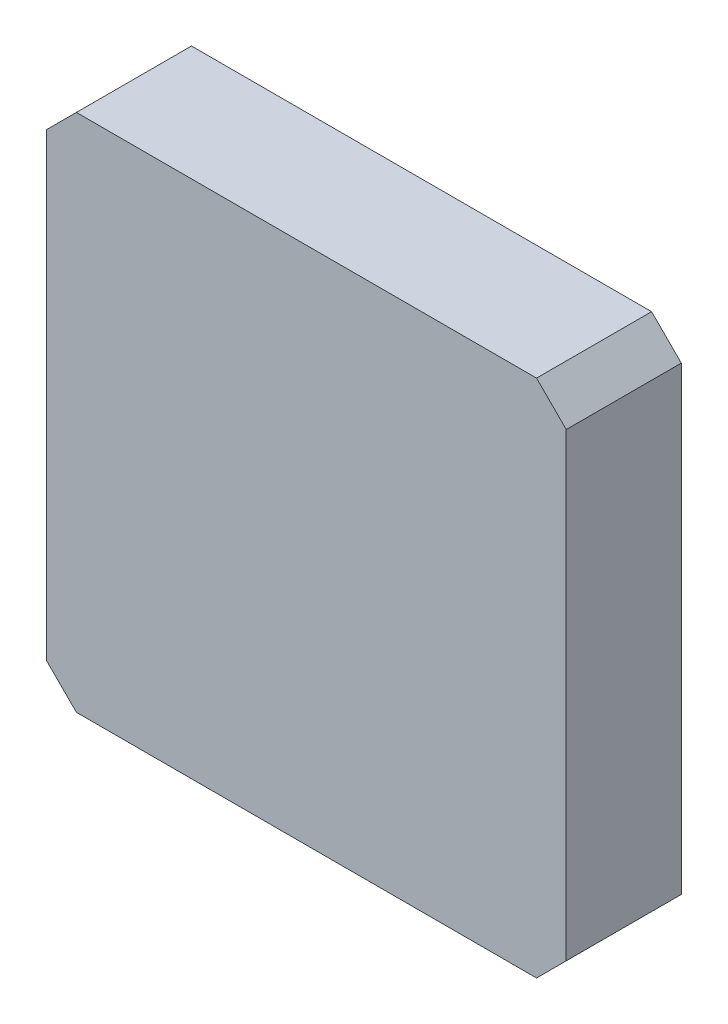
ISO-10303-21;
HEADER;
FILE_DESCRIPTION(('STEP AP214'),'2;1');
FILE_NAME('part.step','',(''),(''),'','','');
FILE_SCHEMA(('AUTOMOTIVE_DESIGN { 1 0 10303 214 1 1 1 1 }'));
ENDSEC;
DATA;
#1=APPLICATION_CONTEXT('core data for automotive mechanical design processes');
#2=APPLICATION_PROTOCOL_DEFINITION('international standard','automotive_design',2000,#1);
#3=PRODUCT_CONTEXT('',#1,'mechanical');
#4=PRODUCT('Part','Part','',(#3));
#5=PRODUCT_RELATED_PRODUCT_CATEGORY('part','',(#4));
#6=PRODUCT_DEFINITION_FORMATION('','',#4);
#7=PRODUCT_DEFINITION_CONTEXT('part definition',#1,'design');
#8=PRODUCT_DEFINITION('design','',#6,#7);
#9=PRODUCT_DEFINITION_SHAPE('','',#8);
#10=(LENGTH_UNIT() NAMED_UNIT(*) SI_UNIT(.MILLI.,.METRE.));
#11=(NAMED_UNIT(*) PLANE_ANGLE_UNIT() SI_UNIT($,.RADIAN.));
#12=(NAMED_UNIT(*) SI_UNIT($,.STERADIAN.) SOLID_ANGLE_UNIT());
#13=UNCERTAINTY_MEASURE_WITH_UNIT(LENGTH_MEASURE(1.E-05),#10,'distance_accuracy_value','');
#14=(GEOMETRIC_REPRESENTATION_CONTEXT(3) GLOBAL_UNCERTAINTY_ASSIGNED_CONTEXT((#13)) GLOBAL_UNIT_ASSIGNED_CONTEXT((#10,
#11,#12)) REPRESENTATION_CONTEXT('',''));
#15=CARTESIAN_POINT('',(0.,0.,0.));
#16=DIRECTION('',(0.,0.,1.));
#17=DIRECTION('',(1.,0.,0.));
#18=AXIS2_PLACEMENT_3D('',#15,#16,#17);
#19=CARTESIAN_POINT('',(-3.09999888,-3.49999808,0.));
#20=DIRECTION('',(0.,0.,1.));
#21=DIRECTION('',(1.,0.,0.));
#22=AXIS2_PLACEMENT_3D('',#19,#20,#21);
#23=PLANE('',#22);
#24=DIRECTION('',(0.,-1.,0.));
#25=VECTOR('',#24,1.);
#26=CARTESIAN_POINT('',(-3.49999808,-3.49999808,0.));
#27=LINE('',#26,#25);
#28=CARTESIAN_POINT('',(-3.49999808,3.10000142,0.));
#29=VERTEX_POINT('',#28);
#30=CARTESIAN_POINT('',(-3.49999808,-3.09999888,0.));
#31=VERTEX_POINT('',#30);
#32=EDGE_CURVE('E11',#29,#31,#27,.T.);
#33=ORIENTED_EDGE('',*,*,#32,.F.);
#34=DIRECTION('',(-0.707106781186548,-0.707106781186548,0.));
#35=VECTOR('',#34,1.);
#36=CARTESIAN_POINT('',(-3.49999808,3.10000142,0.));
#37=LINE('',#36,#35);
#38=CARTESIAN_POINT('',(-3.09999888,3.50000062,0.));
#39=VERTEX_POINT('',#38);
#40=EDGE_CURVE('E162',#39,#29,#37,.T.);
#41=ORIENTED_EDGE('',*,*,#40,.F.);
#42=DIRECTION('',(-1.,0.,0.));
#43=VECTOR('',#42,1.);
#44=CARTESIAN_POINT('',(-3.09999888,3.50000062,0.));
#45=LINE('',#44,#43);
#46=CARTESIAN_POINT('',(3.10000142,3.50000062,0.));
#47=VERTEX_POINT('',#46);
#48=EDGE_CURVE('E27',#47,#39,#45,.T.);
#49=ORIENTED_EDGE('',*,*,#48,.F.);
#50=DIRECTION('',(-0.707106781186548,0.707106781186548,0.));
#51=VECTOR('',#50,1.);
#52=CARTESIAN_POINT('',(3.10000142,3.50000062,0.));
#53=LINE('',#52,#51);
#54=CARTESIAN_POINT('',(3.50000062,3.10000142,0.));
#55=VERTEX_POINT('',#54);
#56=EDGE_CURVE('E144',#55,#47,#53,.T.);
#57=ORIENTED_EDGE('',*,*,#56,.F.);
#58=DIRECTION('',(0.,1.,0.));
#59=VECTOR('',#58,1.);
#60=CARTESIAN_POINT('',(3.50000062,-3.49999808,0.));
#61=LINE('',#60,#59);
#62=CARTESIAN_POINT('',(3.50000062,-3.09999888,0.));
#63=VERTEX_POINT('',#62);
#64=EDGE_CURVE('E169',#63,#55,#61,.T.);
#65=ORIENTED_EDGE('',*,*,#64,.F.);
#66=DIRECTION('',(0.707106781186548,0.707106781186548,0.));
#67=VECTOR('',#66,1.);
#68=CARTESIAN_POINT('',(3.50000062,-3.09999888,0.));
#69=LINE('',#68,#67);
#70=CARTESIAN_POINT('',(3.10000142,-3.49999808,0.));
#71=VERTEX_POINT('',#70);
#72=EDGE_CURVE('E127',#71,#63,#69,.T.);
#73=ORIENTED_EDGE('',*,*,#72,.F.);
#74=DIRECTION('',(1.,0.,0.));
#75=VECTOR('',#74,1.);
#76=CARTESIAN_POINT('',(-3.09999888,-3.49999808,0.));
#77=LINE('',#76,#75);
#78=CARTESIAN_POINT('',(-3.09999888,-3.49999808,0.));
#79=VERTEX_POINT('',#78);
#80=EDGE_CURVE('E165',#79,#71,#77,.T.);
#81=ORIENTED_EDGE('',*,*,#80,.F.);
#82=DIRECTION('',(0.707106781186548,-0.707106781186548,0.));
#83=VECTOR('',#82,1.);
#84=CARTESIAN_POINT('',(-3.09999888,-3.49999808,0.));
#85=LINE('',#84,#83);
#86=EDGE_CURVE('E111',#31,#79,#85,.T.);
#87=ORIENTED_EDGE('',*,*,#86,.F.);
#88=EDGE_LOOP('',(#33,#41,#49,#57,#65,#73,#81,#87));
#89=FACE_BOUND('',#88,.T.);
#90=ADVANCED_FACE('F17',(#89),#23,.F.);
#91=CARTESIAN_POINT('',(-3.49999808,-3.09999888,0.));
#92=DIRECTION('',(-1.,0.,0.));
#93=DIRECTION('',(0.,0.,1.));
#94=AXIS2_PLACEMENT_3D('',#91,#92,#93);
#95=PLANE('',#94);
#96=DIRECTION('',(0.,0.,-1.));
#97=VECTOR('',#96,1.);
#98=CARTESIAN_POINT('',(-3.49999808,3.10000142,0.));
#99=LINE('',#98,#97);
#100=CARTESIAN_POINT('',(-3.49999808,3.10000142,1.55));
#101=VERTEX_POINT('',#100);
#102=EDGE_CURVE('E54',#101,#29,#99,.T.);
#103=ORIENTED_EDGE('',*,*,#102,.T.);
#104=ORIENTED_EDGE('',*,*,#32,.T.);
#105=DIRECTION('',(0.,0.,1.));
#106=VECTOR('',#105,1.);
#107=CARTESIAN_POINT('',(-3.49999808,-3.09999888,0.));
#108=LINE('',#107,#106);
#109=CARTESIAN_POINT('',(-3.49999808,-3.09999888,1.55));
#110=VERTEX_POINT('',#109);
#111=EDGE_CURVE('E105',#31,#110,#108,.T.);
#112=ORIENTED_EDGE('',*,*,#111,.T.);
#113=DIRECTION('',(0.,1.,0.));
#114=VECTOR('',#113,1.);
#115=CARTESIAN_POINT('',(-3.49999808,-3.09999888,1.55));
#116=LINE('',#115,#114);
#117=EDGE_CURVE('E90',#110,#101,#116,.T.);
#118=ORIENTED_EDGE('',*,*,#117,.T.);
#119=EDGE_LOOP('',(#103,#104,#112,#118));
#120=FACE_BOUND('',#119,.T.);
#121=ADVANCED_FACE('F109',(#120),#95,.T.);
#122=CARTESIAN_POINT('',(-3.09999888,3.50000062,0.));
#123=DIRECTION('',(0.,1.,0.));
#124=DIRECTION('',(1.,0.,0.));
#125=AXIS2_PLACEMENT_3D('',#122,#123,#124);
#126=PLANE('',#125);
#127=DIRECTION('',(0.,0.,-1.));
#128=VECTOR('',#127,1.);
#129=CARTESIAN_POINT('',(3.10000142,3.50000062,0.));
#130=LINE('',#129,#128);
#131=CARTESIAN_POINT('',(3.10000142,3.50000062,1.55));
#132=VERTEX_POINT('',#131);
#133=EDGE_CURVE('E121',#132,#47,#130,.T.);
#134=ORIENTED_EDGE('',*,*,#133,.T.);
#135=ORIENTED_EDGE('',*,*,#48,.T.);
#136=DIRECTION('',(0.,0.,1.));
#137=VECTOR('',#136,1.);
#138=CARTESIAN_POINT('',(-3.09999888,3.50000062,0.));
#139=LINE('',#138,#137);
#140=CARTESIAN_POINT('',(-3.09999888,3.50000062,1.55));
#141=VERTEX_POINT('',#140);
#142=EDGE_CURVE('E159',#39,#141,#139,.T.);
#143=ORIENTED_EDGE('',*,*,#142,.T.);
#144=DIRECTION('',(1.,0.,0.));
#145=VECTOR('',#144,1.);
#146=CARTESIAN_POINT('',(-3.09999888,3.50000062,1.55));
#147=LINE('',#146,#145);
#148=EDGE_CURVE('E125',#141,#132,#147,.T.);
#149=ORIENTED_EDGE('',*,*,#148,.T.);
#150=EDGE_LOOP('',(#134,#135,#143,#149));
#151=FACE_BOUND('',#150,.T.);
#152=ADVANCED_FACE('F19',(#151),#126,.T.);
#153=CARTESIAN_POINT('',(3.50000062,3.10000142,0.));
#154=DIRECTION('',(1.,0.,0.));
#155=DIRECTION('',(0.,1.,0.));
#156=AXIS2_PLACEMENT_3D('',#153,#154,#155);
#157=PLANE('',#156);
#158=DIRECTION('',(0.,0.,-1.));
#159=VECTOR('',#158,1.);
#160=CARTESIAN_POINT('',(3.50000062,-3.09999888,0.));
#161=LINE('',#160,#159);
#162=CARTESIAN_POINT('',(3.50000062,-3.09999888,1.55));
#163=VERTEX_POINT('',#162);
#164=EDGE_CURVE('E130',#163,#63,#161,.T.);
#165=ORIENTED_EDGE('',*,*,#164,.T.);
#166=ORIENTED_EDGE('',*,*,#64,.T.);
#167=DIRECTION('',(0.,0.,1.));
#168=VECTOR('',#167,1.);
#169=CARTESIAN_POINT('',(3.50000062,3.10000142,0.));
#170=LINE('',#169,#168);
#171=CARTESIAN_POINT('',(3.50000062,3.10000142,1.55));
#172=VERTEX_POINT('',#171);
#173=EDGE_CURVE('E139',#55,#172,#170,.T.);
#174=ORIENTED_EDGE('',*,*,#173,.T.);
#175=DIRECTION('',(0.,-1.,0.));
#176=VECTOR('',#175,1.);
#177=CARTESIAN_POINT('',(3.50000062,3.10000142,1.55));
#178=LINE('',#177,#176);
#179=EDGE_CURVE('E153',#172,#163,#178,.T.);
#180=ORIENTED_EDGE('',*,*,#179,.T.);
#181=EDGE_LOOP('',(#165,#166,#174,#180));
#182=FACE_BOUND('',#181,.T.);
#183=ADVANCED_FACE('F262',(#182),#157,.T.);
#184=CARTESIAN_POINT('',(3.10000142,-3.49999808,0.));
#185=DIRECTION('',(0.,-1.,0.));
#186=DIRECTION('',(0.,0.,-1.));
#187=AXIS2_PLACEMENT_3D('',#184,#185,#186);
#188=PLANE('',#187);
#189=DIRECTION('',(0.,0.,-1.));
#190=VECTOR('',#189,1.);
#191=CARTESIAN_POINT('',(-3.09999888,-3.49999808,0.));
#192=LINE('',#191,#190);
#193=CARTESIAN_POINT('',(-3.09999888,-3.49999808,1.55));
#194=VERTEX_POINT('',#193);
#195=EDGE_CURVE('E106',#194,#79,#192,.T.);
#196=ORIENTED_EDGE('',*,*,#195,.T.);
#197=ORIENTED_EDGE('',*,*,#80,.T.);
#198=DIRECTION('',(0.,0.,1.));
#199=VECTOR('',#198,1.);
#200=CARTESIAN_POINT('',(3.10000142,-3.49999808,0.));
#201=LINE('',#200,#199);
#202=CARTESIAN_POINT('',(3.10000142,-3.49999808,1.55));
#203=VERTEX_POINT('',#202);
#204=EDGE_CURVE('E131',#71,#203,#201,.T.);
#205=ORIENTED_EDGE('',*,*,#204,.T.);
#206=DIRECTION('',(-1.,0.,0.));
#207=VECTOR('',#206,1.);
#208=CARTESIAN_POINT('',(3.10000142,-3.49999808,1.55));
#209=LINE('',#208,#207);
#210=EDGE_CURVE('E67',#203,#194,#209,.T.);
#211=ORIENTED_EDGE('',*,*,#210,.T.);
#212=EDGE_LOOP('',(#196,#197,#205,#211));
#213=FACE_BOUND('',#212,.T.);
#214=ADVANCED_FACE('F239',(#213),#188,.T.);
#215=CARTESIAN_POINT('',(-3.49999808,3.10000142,0.));
#216=DIRECTION('',(-0.707106781186548,0.707106781186548,0.));
#217=DIRECTION('',(0.,0.,1.));
#218=AXIS2_PLACEMENT_3D('',#215,#216,#217);
#219=PLANE('',#218);
#220=ORIENTED_EDGE('',*,*,#142,.F.);
#221=ORIENTED_EDGE('',*,*,#40,.T.);
#222=ORIENTED_EDGE('',*,*,#102,.F.);
#223=DIRECTION('',(0.707106781186548,0.707106781186548,0.));
#224=VECTOR('',#223,1.);
#225=CARTESIAN_POINT('',(-3.49999808,3.10000142,1.55));
#226=LINE('',#225,#224);
#227=EDGE_CURVE('E96',#101,#141,#226,.T.);
#228=ORIENTED_EDGE('',*,*,#227,.T.);
#229=EDGE_LOOP('',(#220,#221,#222,#228));
#230=FACE_BOUND('',#229,.T.);
#231=ADVANCED_FACE('F182',(#230),#219,.T.);
#232=CARTESIAN_POINT('',(-3.09999888,-3.49999808,1.55));
#233=DIRECTION('',(0.,0.,1.));
#234=DIRECTION('',(1.,0.,0.));
#235=AXIS2_PLACEMENT_3D('',#232,#233,#234);
#236=PLANE('',#235);
#237=ORIENTED_EDGE('',*,*,#117,.F.);
#238=DIRECTION('',(0.707106781186548,-0.707106781186548,0.));
#239=VECTOR('',#238,1.);
#240=CARTESIAN_POINT('',(-3.49999808,-3.09999888,1.55));
#241=LINE('',#240,#239);
#242=EDGE_CURVE('E93',#110,#194,#241,.T.);
#243=ORIENTED_EDGE('',*,*,#242,.T.);
#244=ORIENTED_EDGE('',*,*,#210,.F.);
#245=DIRECTION('',(0.707106781186548,0.707106781186548,0.));
#246=VECTOR('',#245,1.);
#247=CARTESIAN_POINT('',(3.10000142,-3.49999808,1.55));
#248=LINE('',#247,#246);
#249=EDGE_CURVE('E136',#203,#163,#248,.T.);
#250=ORIENTED_EDGE('',*,*,#249,.T.);
#251=ORIENTED_EDGE('',*,*,#179,.F.);
#252=DIRECTION('',(-0.707106781186548,0.707106781186548,0.));
#253=VECTOR('',#252,1.);
#254=CARTESIAN_POINT('',(3.50000062,3.10000142,1.55));
#255=LINE('',#254,#253);
#256=EDGE_CURVE('E112',#172,#132,#255,.T.);
#257=ORIENTED_EDGE('',*,*,#256,.T.);
#258=ORIENTED_EDGE('',*,*,#148,.F.);
#259=ORIENTED_EDGE('',*,*,#227,.F.);
#260=EDGE_LOOP('',(#237,#243,#244,#250,#251,#257,#258,#259));
#261=FACE_BOUND('',#260,.T.);
#262=ADVANCED_FACE('F92',(#261),#236,.T.);
#263=CARTESIAN_POINT('',(-3.09999888,-3.49999808,0.));
#264=DIRECTION('',(-0.707106781186548,-0.707106781186548,0.));
#265=DIRECTION('',(-0.707106781186548,0.707106781186548,0.));
#266=AXIS2_PLACEMENT_3D('',#263,#264,#265);
#267=PLANE('',#266);
#268=ORIENTED_EDGE('',*,*,#111,.F.);
#269=ORIENTED_EDGE('',*,*,#86,.T.);
#270=ORIENTED_EDGE('',*,*,#195,.F.);
#271=ORIENTED_EDGE('',*,*,#242,.F.);
#272=EDGE_LOOP('',(#268,#269,#270,#271));
#273=FACE_BOUND('',#272,.T.);
#274=ADVANCED_FACE('F103',(#273),#267,.T.);
#275=CARTESIAN_POINT('',(3.10000142,3.50000062,0.));
#276=DIRECTION('',(0.707106781186548,0.707106781186548,0.));
#277=DIRECTION('',(0.,0.,-1.));
#278=AXIS2_PLACEMENT_3D('',#275,#276,#277);
#279=PLANE('',#278);
#280=ORIENTED_EDGE('',*,*,#173,.F.);
#281=ORIENTED_EDGE('',*,*,#56,.T.);
#282=ORIENTED_EDGE('',*,*,#133,.F.);
#283=ORIENTED_EDGE('',*,*,#256,.F.);
#284=EDGE_LOOP('',(#280,#281,#282,#283));
#285=FACE_BOUND('',#284,.T.);
#286=ADVANCED_FACE('F265',(#285),#279,.T.);
#287=CARTESIAN_POINT('',(3.50000062,-3.09999888,0.));
#288=DIRECTION('',(0.707106781186548,-0.707106781186548,0.));
#289=DIRECTION('',(0.,0.,-1.));
#290=AXIS2_PLACEMENT_3D('',#287,#288,#289);
#291=PLANE('',#290);
#292=ORIENTED_EDGE('',*,*,#204,.F.);
#293=ORIENTED_EDGE('',*,*,#72,.T.);
#294=ORIENTED_EDGE('',*,*,#164,.F.);
#295=ORIENTED_EDGE('',*,*,#249,.F.);
#296=EDGE_LOOP('',(#292,#293,#294,#295));
#297=FACE_BOUND('',#296,.T.);
#298=ADVANCED_FACE('F247',(#297),#291,.T.);
#299=CLOSED_SHELL('',(#90,#121,#152,#183,#214,#231,#262,#274,#286,#298));
#300=MANIFOLD_SOLID_BREP('B1',#299);
#301=ADVANCED_BREP_SHAPE_REPRESENTATION('',(#18,#300),#14);
#302=SHAPE_DEFINITION_REPRESENTATION(#9,#301);
ENDSEC;
END-ISO-10303-21;
